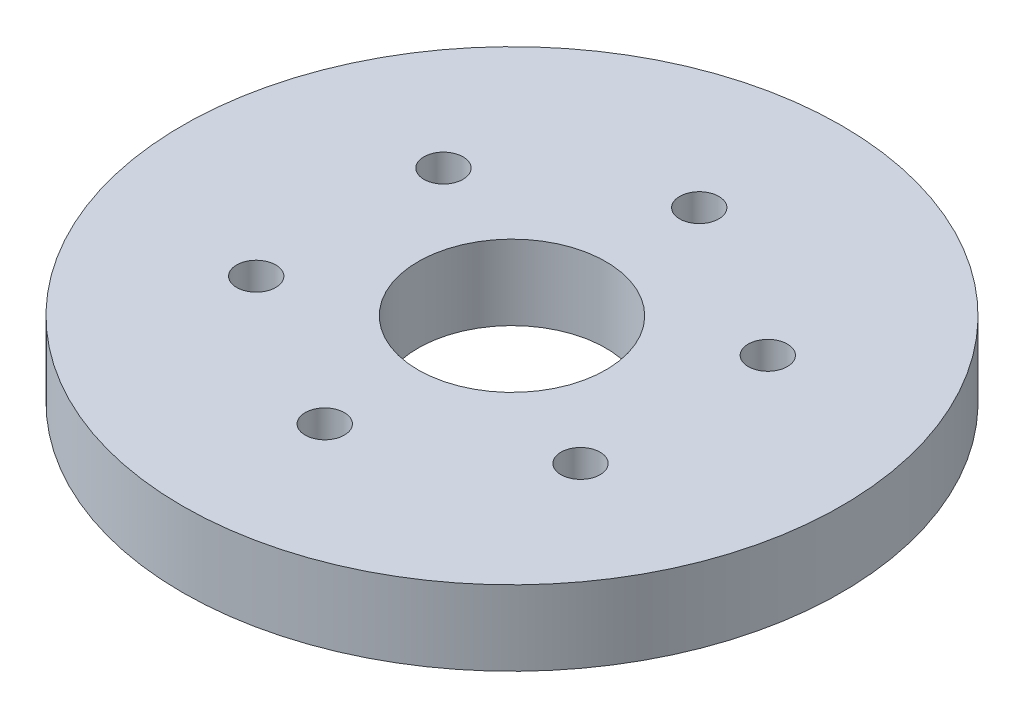
ISO-10303-21;
HEADER;
FILE_DESCRIPTION(('STEP AP214'),'2;1');
FILE_NAME('part.step','',(''),(''),'','','');
FILE_SCHEMA(('AUTOMOTIVE_DESIGN { 1 0 10303 214 1 1 1 1 }'));
ENDSEC;
DATA;
#1=APPLICATION_CONTEXT('core data for automotive mechanical design processes');
#2=APPLICATION_PROTOCOL_DEFINITION('international standard','automotive_design',2000,#1);
#3=PRODUCT_CONTEXT('',#1,'mechanical');
#4=PRODUCT('Part','Part','',(#3));
#5=PRODUCT_RELATED_PRODUCT_CATEGORY('part','',(#4));
#6=PRODUCT_DEFINITION_FORMATION('','',#4);
#7=PRODUCT_DEFINITION_CONTEXT('part definition',#1,'design');
#8=PRODUCT_DEFINITION('design','',#6,#7);
#9=PRODUCT_DEFINITION_SHAPE('','',#8);
#10=(LENGTH_UNIT() NAMED_UNIT(*) SI_UNIT(.MILLI.,.METRE.));
#11=(NAMED_UNIT(*) PLANE_ANGLE_UNIT() SI_UNIT($,.RADIAN.));
#12=(NAMED_UNIT(*) SI_UNIT($,.STERADIAN.) SOLID_ANGLE_UNIT());
#13=UNCERTAINTY_MEASURE_WITH_UNIT(LENGTH_MEASURE(1.E-05),#10,'distance_accuracy_value','');
#14=(GEOMETRIC_REPRESENTATION_CONTEXT(3) GLOBAL_UNCERTAINTY_ASSIGNED_CONTEXT((#13)) GLOBAL_UNIT_ASSIGNED_CONTEXT((#10,
#11,#12)) REPRESENTATION_CONTEXT('',''));
#15=CARTESIAN_POINT('',(0.,0.,0.));
#16=DIRECTION('',(0.,0.,1.));
#17=DIRECTION('',(1.,0.,0.));
#18=AXIS2_PLACEMENT_3D('',#15,#16,#17);
#19=CARTESIAN_POINT('',(0.,0.,0.));
#20=DIRECTION('',(0.,1.,0.));
#21=DIRECTION('',(1.,0.,0.));
#22=AXIS2_PLACEMENT_3D('',#19,#20,#21);
#23=PLANE('',#22);
#24=CARTESIAN_POINT('',(-20.6222299276169,0.,-11.90625));
#25=DIRECTION('',(0.,1.,0.));
#26=DIRECTION('',(0.,0.,1.));
#27=AXIS2_PLACEMENT_3D('',#24,#25,#26);
#28=CIRCLE('',#27,2.48920000000028);
#29=CARTESIAN_POINT('',(-20.6222299276169,0.,-9.41704999999972));
#30=VERTEX_POINT('',#29);
#31=EDGE_CURVE('E90',#30,#30,#28,.T.);
#32=ORIENTED_EDGE('',*,*,#31,.T.);
#33=EDGE_LOOP('',(#32));
#34=FACE_BOUND('',#33,.T.);
#35=CARTESIAN_POINT('',(-20.6222299276169,0.,11.90625));
#36=DIRECTION('',(0.,1.,0.));
#37=DIRECTION('',(0.,0.,1.));
#38=AXIS2_PLACEMENT_3D('',#35,#36,#37);
#39=CIRCLE('',#38,2.48920000000023);
#40=CARTESIAN_POINT('',(-20.6222299276169,0.,14.3954500000002));
#41=VERTEX_POINT('',#40);
#42=EDGE_CURVE('E91',#41,#41,#39,.T.);
#43=ORIENTED_EDGE('',*,*,#42,.T.);
#44=EDGE_LOOP('',(#43));
#45=FACE_BOUND('',#44,.T.);
#46=CARTESIAN_POINT('',(0.,0.,23.8125));
#47=DIRECTION('',(0.,1.,0.));
#48=DIRECTION('',(0.,0.,1.));
#49=AXIS2_PLACEMENT_3D('',#46,#47,#48);
#50=CIRCLE('',#49,2.48920000000016);
#51=CARTESIAN_POINT('',(0.,0.,26.3017000000002));
#52=VERTEX_POINT('',#51);
#53=EDGE_CURVE('E100',#52,#52,#50,.T.);
#54=ORIENTED_EDGE('',*,*,#53,.T.);
#55=EDGE_LOOP('',(#54));
#56=FACE_BOUND('',#55,.T.);
#57=CARTESIAN_POINT('',(20.6222299276169,0.,11.90625));
#58=DIRECTION('',(0.,1.,0.));
#59=DIRECTION('',(0.,0.,1.));
#60=AXIS2_PLACEMENT_3D('',#57,#58,#59);
#61=CIRCLE('',#60,2.48920000000011);
#62=CARTESIAN_POINT('',(20.6222299276169,0.,14.3954500000001));
#63=VERTEX_POINT('',#62);
#64=EDGE_CURVE('E101',#63,#63,#61,.T.);
#65=ORIENTED_EDGE('',*,*,#64,.T.);
#66=EDGE_LOOP('',(#65));
#67=FACE_BOUND('',#66,.T.);
#68=CARTESIAN_POINT('',(20.6222299276176,0.,-11.90625));
#69=DIRECTION('',(0.,1.,0.));
#70=DIRECTION('',(0.,0.,1.));
#71=AXIS2_PLACEMENT_3D('',#68,#69,#70);
#72=CIRCLE('',#71,2.48919999999956);
#73=CARTESIAN_POINT('',(20.6222299276176,0.,-9.41705000000044));
#74=VERTEX_POINT('',#73);
#75=EDGE_CURVE('E104',#74,#74,#72,.T.);
#76=ORIENTED_EDGE('',*,*,#75,.T.);
#77=EDGE_LOOP('',(#76));
#78=FACE_BOUND('',#77,.T.);
#79=CARTESIAN_POINT('',(0.,0.,0.));
#80=DIRECTION('',(0.,1.,0.));
#81=DIRECTION('',(0.,0.,1.));
#82=AXIS2_PLACEMENT_3D('',#79,#80,#81);
#83=CIRCLE('',#82,11.938);
#84=CARTESIAN_POINT('',(0.,0.,11.938));
#85=VERTEX_POINT('',#84);
#86=EDGE_CURVE('E40',#85,#85,#83,.T.);
#87=ORIENTED_EDGE('',*,*,#86,.T.);
#88=EDGE_LOOP('',(#87));
#89=FACE_BOUND('',#88,.T.);
#90=CARTESIAN_POINT('',(0.,0.,-23.8125));
#91=DIRECTION('',(0.,1.,0.));
#92=DIRECTION('',(0.,0.,1.));
#93=AXIS2_PLACEMENT_3D('',#90,#91,#92);
#94=CIRCLE('',#93,2.4892);
#95=CARTESIAN_POINT('',(0.,0.,-21.3233));
#96=VERTEX_POINT('',#95);
#97=EDGE_CURVE('E32',#96,#96,#94,.T.);
#98=ORIENTED_EDGE('',*,*,#97,.T.);
#99=EDGE_LOOP('',(#98));
#100=FACE_BOUND('',#99,.T.);
#101=CARTESIAN_POINT('',(0.,0.,0.));
#102=DIRECTION('',(0.,1.,0.));
#103=DIRECTION('',(0.,0.,1.));
#104=AXIS2_PLACEMENT_3D('',#101,#102,#103);
#105=CIRCLE('',#104,41.91);
#106=CARTESIAN_POINT('',(0.,0.,41.91));
#107=VERTEX_POINT('',#106);
#108=EDGE_CURVE('E10',#107,#107,#105,.T.);
#109=ORIENTED_EDGE('',*,*,#108,.F.);
#110=EDGE_LOOP('',(#109));
#111=FACE_BOUND('',#110,.T.);
#112=ADVANCED_FACE('F15',(#34,#45,#56,#67,#78,#89,#100,#111),#23,.F.);
#113=CARTESIAN_POINT('',(0.,9.525,0.));
#114=DIRECTION('',(0.,1.,0.));
#115=DIRECTION('',(1.,0.,0.));
#116=AXIS2_PLACEMENT_3D('',#113,#114,#115);
#117=PLANE('',#116);
#118=CARTESIAN_POINT('',(-20.6222299276169,9.525,-11.90625));
#119=DIRECTION('',(0.,1.,0.));
#120=DIRECTION('',(0.,0.,1.));
#121=AXIS2_PLACEMENT_3D('',#118,#119,#120);
#122=CIRCLE('',#121,2.48920000000028);
#123=CARTESIAN_POINT('',(-20.6222299276169,9.525,-9.41704999999972));
#124=VERTEX_POINT('',#123);
#125=EDGE_CURVE('E140',#124,#124,#122,.T.);
#126=ORIENTED_EDGE('',*,*,#125,.F.);
#127=EDGE_LOOP('',(#126));
#128=FACE_BOUND('',#127,.T.);
#129=CARTESIAN_POINT('',(0.,9.525,23.8125));
#130=DIRECTION('',(0.,1.,0.));
#131=DIRECTION('',(0.,0.,1.));
#132=AXIS2_PLACEMENT_3D('',#129,#130,#131);
#133=CIRCLE('',#132,2.48920000000016);
#134=CARTESIAN_POINT('',(0.,9.525,26.3017000000002));
#135=VERTEX_POINT('',#134);
#136=EDGE_CURVE('E127',#135,#135,#133,.T.);
#137=ORIENTED_EDGE('',*,*,#136,.F.);
#138=EDGE_LOOP('',(#137));
#139=FACE_BOUND('',#138,.T.);
#140=CARTESIAN_POINT('',(20.6222299276176,9.525,-11.90625));
#141=DIRECTION('',(0.,1.,0.));
#142=DIRECTION('',(0.,0.,1.));
#143=AXIS2_PLACEMENT_3D('',#140,#141,#142);
#144=CIRCLE('',#143,2.48919999999956);
#145=CARTESIAN_POINT('',(20.6222299276176,9.525,-9.41705000000044));
#146=VERTEX_POINT('',#145);
#147=EDGE_CURVE('E116',#146,#146,#144,.T.);
#148=ORIENTED_EDGE('',*,*,#147,.F.);
#149=EDGE_LOOP('',(#148));
#150=FACE_BOUND('',#149,.T.);
#151=CARTESIAN_POINT('',(0.,9.525,-23.8125));
#152=DIRECTION('',(0.,1.,0.));
#153=DIRECTION('',(0.,0.,1.));
#154=AXIS2_PLACEMENT_3D('',#151,#152,#153);
#155=CIRCLE('',#154,2.4892);
#156=CARTESIAN_POINT('',(0.,9.525,-21.3233));
#157=VERTEX_POINT('',#156);
#158=EDGE_CURVE('E41',#157,#157,#155,.T.);
#159=ORIENTED_EDGE('',*,*,#158,.F.);
#160=EDGE_LOOP('',(#159));
#161=FACE_BOUND('',#160,.T.);
#162=CARTESIAN_POINT('',(0.,9.525,0.));
#163=DIRECTION('',(0.,1.,0.));
#164=DIRECTION('',(0.,0.,1.));
#165=AXIS2_PLACEMENT_3D('',#162,#163,#164);
#166=CIRCLE('',#165,11.938);
#167=CARTESIAN_POINT('',(0.,9.525,11.938));
#168=VERTEX_POINT('',#167);
#169=EDGE_CURVE('E34',#168,#168,#166,.T.);
#170=ORIENTED_EDGE('',*,*,#169,.F.);
#171=EDGE_LOOP('',(#170));
#172=FACE_BOUND('',#171,.T.);
#173=CARTESIAN_POINT('',(20.6222299276169,9.525,11.90625));
#174=DIRECTION('',(0.,1.,0.));
#175=DIRECTION('',(0.,0.,1.));
#176=AXIS2_PLACEMENT_3D('',#173,#174,#175);
#177=CIRCLE('',#176,2.48920000000011);
#178=CARTESIAN_POINT('',(20.6222299276169,9.525,14.3954500000001));
#179=VERTEX_POINT('',#178);
#180=EDGE_CURVE('E75',#179,#179,#177,.T.);
#181=ORIENTED_EDGE('',*,*,#180,.F.);
#182=EDGE_LOOP('',(#181));
#183=FACE_BOUND('',#182,.T.);
#184=CARTESIAN_POINT('',(-20.6222299276169,9.525,11.90625));
#185=DIRECTION('',(0.,1.,0.));
#186=DIRECTION('',(0.,0.,1.));
#187=AXIS2_PLACEMENT_3D('',#184,#185,#186);
#188=CIRCLE('',#187,2.48920000000023);
#189=CARTESIAN_POINT('',(-20.6222299276169,9.525,14.3954500000002));
#190=VERTEX_POINT('',#189);
#191=EDGE_CURVE('E74',#190,#190,#188,.T.);
#192=ORIENTED_EDGE('',*,*,#191,.F.);
#193=EDGE_LOOP('',(#192));
#194=FACE_BOUND('',#193,.T.);
#195=CARTESIAN_POINT('',(0.,9.525,0.));
#196=DIRECTION('',(0.,1.,0.));
#197=DIRECTION('',(0.,0.,1.));
#198=AXIS2_PLACEMENT_3D('',#195,#196,#197);
#199=CIRCLE('',#198,41.91);
#200=CARTESIAN_POINT('',(0.,9.525,41.91));
#201=VERTEX_POINT('',#200);
#202=EDGE_CURVE('E18',#201,#201,#199,.T.);
#203=ORIENTED_EDGE('',*,*,#202,.T.);
#204=EDGE_LOOP('',(#203));
#205=FACE_BOUND('',#204,.T.);
#206=ADVANCED_FACE('F58',(#128,#139,#150,#161,#172,#183,#194,#205),#117,.T.);
#207=CARTESIAN_POINT('',(0.,9.525,0.));
#208=DIRECTION('',(0.,-1.,0.));
#209=DIRECTION('',(0.,0.,-1.));
#210=AXIS2_PLACEMENT_3D('',#207,#208,#209);
#211=CYLINDRICAL_SURFACE('',#210,41.91);
#212=ORIENTED_EDGE('',*,*,#108,.T.);
#213=EDGE_LOOP('',(#212));
#214=FACE_BOUND('',#213,.T.);
#215=ORIENTED_EDGE('',*,*,#202,.F.);
#216=EDGE_LOOP('',(#215));
#217=FACE_BOUND('',#216,.T.);
#218=ADVANCED_FACE('F57',(#214,#217),#211,.T.);
#219=CARTESIAN_POINT('',(0.,9.525,-23.8125));
#220=DIRECTION('',(0.,-1.,0.));
#221=DIRECTION('',(0.,0.,-1.));
#222=AXIS2_PLACEMENT_3D('',#219,#220,#221);
#223=CYLINDRICAL_SURFACE('',#222,2.4892);
#224=ORIENTED_EDGE('',*,*,#97,.F.);
#225=EDGE_LOOP('',(#224));
#226=FACE_BOUND('',#225,.T.);
#227=ORIENTED_EDGE('',*,*,#158,.T.);
#228=EDGE_LOOP('',(#227));
#229=FACE_BOUND('',#228,.T.);
#230=ADVANCED_FACE('F55',(#226,#229),#223,.F.);
#231=CARTESIAN_POINT('',(0.,9.525,0.));
#232=DIRECTION('',(0.,-1.,0.));
#233=DIRECTION('',(0.,0.,-1.));
#234=AXIS2_PLACEMENT_3D('',#231,#232,#233);
#235=CYLINDRICAL_SURFACE('',#234,11.938);
#236=ORIENTED_EDGE('',*,*,#86,.F.);
#237=EDGE_LOOP('',(#236));
#238=FACE_BOUND('',#237,.T.);
#239=ORIENTED_EDGE('',*,*,#169,.T.);
#240=EDGE_LOOP('',(#239));
#241=FACE_BOUND('',#240,.T.);
#242=ADVANCED_FACE('F54',(#238,#241),#235,.F.);
#243=CARTESIAN_POINT('',(20.6222299276176,9.525,-11.90625));
#244=DIRECTION('',(0.,-1.,0.));
#245=DIRECTION('',(0.,0.,-1.));
#246=AXIS2_PLACEMENT_3D('',#243,#244,#245);
#247=CYLINDRICAL_SURFACE('',#246,2.48919999999956);
#248=ORIENTED_EDGE('',*,*,#75,.F.);
#249=EDGE_LOOP('',(#248));
#250=FACE_BOUND('',#249,.T.);
#251=ORIENTED_EDGE('',*,*,#147,.T.);
#252=EDGE_LOOP('',(#251));
#253=FACE_BOUND('',#252,.T.);
#254=ADVANCED_FACE('F109',(#250,#253),#247,.F.);
#255=CARTESIAN_POINT('',(20.6222299276169,9.525,11.90625));
#256=DIRECTION('',(0.,-1.,0.));
#257=DIRECTION('',(0.,0.,-1.));
#258=AXIS2_PLACEMENT_3D('',#255,#256,#257);
#259=CYLINDRICAL_SURFACE('',#258,2.48920000000011);
#260=ORIENTED_EDGE('',*,*,#64,.F.);
#261=EDGE_LOOP('',(#260));
#262=FACE_BOUND('',#261,.T.);
#263=ORIENTED_EDGE('',*,*,#180,.T.);
#264=EDGE_LOOP('',(#263));
#265=FACE_BOUND('',#264,.T.);
#266=ADVANCED_FACE('F153',(#262,#265),#259,.F.);
#267=CARTESIAN_POINT('',(0.,9.525,23.8125));
#268=DIRECTION('',(0.,-1.,0.));
#269=DIRECTION('',(0.,0.,-1.));
#270=AXIS2_PLACEMENT_3D('',#267,#268,#269);
#271=CYLINDRICAL_SURFACE('',#270,2.48920000000016);
#272=ORIENTED_EDGE('',*,*,#53,.F.);
#273=EDGE_LOOP('',(#272));
#274=FACE_BOUND('',#273,.T.);
#275=ORIENTED_EDGE('',*,*,#136,.T.);
#276=EDGE_LOOP('',(#275));
#277=FACE_BOUND('',#276,.T.);
#278=ADVANCED_FACE('F157',(#274,#277),#271,.F.);
#279=CARTESIAN_POINT('',(-20.6222299276169,9.525,11.90625));
#280=DIRECTION('',(0.,-1.,0.));
#281=DIRECTION('',(0.,0.,-1.));
#282=AXIS2_PLACEMENT_3D('',#279,#280,#281);
#283=CYLINDRICAL_SURFACE('',#282,2.48920000000023);
#284=ORIENTED_EDGE('',*,*,#42,.F.);
#285=EDGE_LOOP('',(#284));
#286=FACE_BOUND('',#285,.T.);
#287=ORIENTED_EDGE('',*,*,#191,.T.);
#288=EDGE_LOOP('',(#287));
#289=FACE_BOUND('',#288,.T.);
#290=ADVANCED_FACE('F164',(#286,#289),#283,.F.);
#291=CARTESIAN_POINT('',(-20.6222299276169,9.525,-11.90625));
#292=DIRECTION('',(0.,-1.,0.));
#293=DIRECTION('',(0.,0.,-1.));
#294=AXIS2_PLACEMENT_3D('',#291,#292,#293);
#295=CYLINDRICAL_SURFACE('',#294,2.48920000000028);
#296=ORIENTED_EDGE('',*,*,#31,.F.);
#297=EDGE_LOOP('',(#296));
#298=FACE_BOUND('',#297,.T.);
#299=ORIENTED_EDGE('',*,*,#125,.T.);
#300=EDGE_LOOP('',(#299));
#301=FACE_BOUND('',#300,.T.);
#302=ADVANCED_FACE('F148',(#298,#301),#295,.F.);
#303=CLOSED_SHELL('',(#112,#206,#218,#230,#242,#254,#266,#278,#290,#302));
#304=MANIFOLD_SOLID_BREP('B1',#303);
#305=ADVANCED_BREP_SHAPE_REPRESENTATION('',(#18,#304),#14);
#306=SHAPE_DEFINITION_REPRESENTATION(#9,#305);
ENDSEC;
END-ISO-10303-21;
